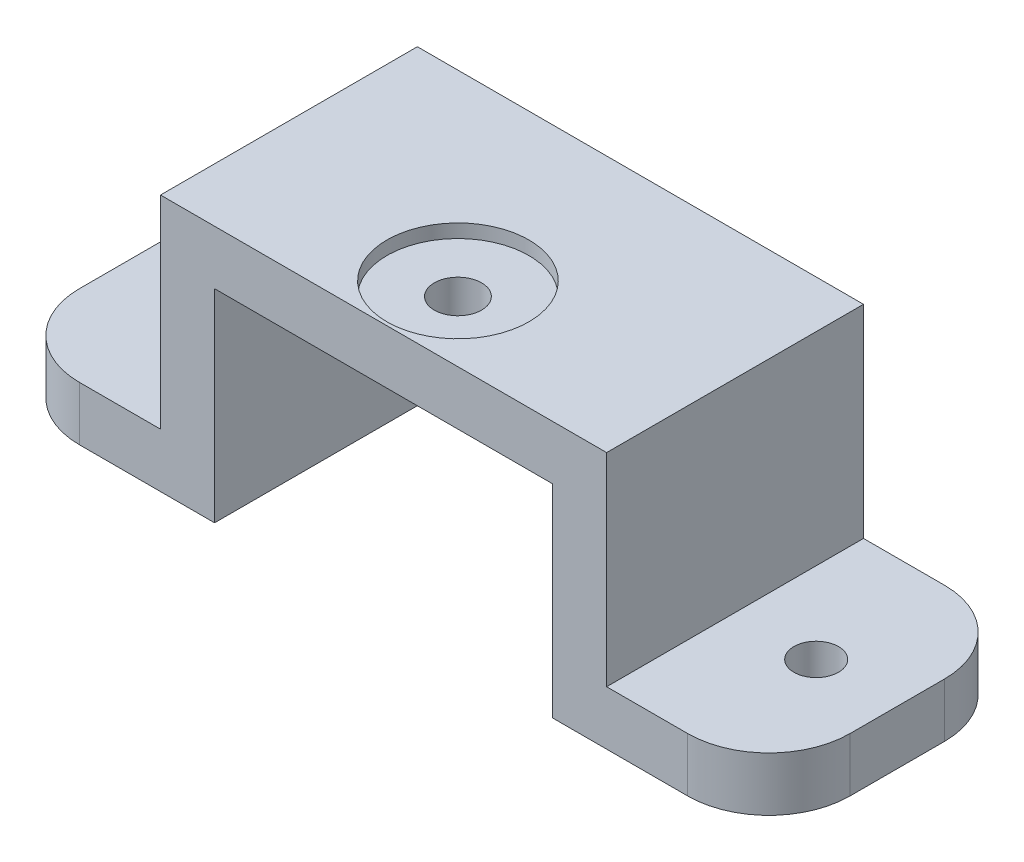
ISO-10303-21;
HEADER;
FILE_DESCRIPTION(('STEP AP214'),'2;1');
FILE_NAME('part.step','',(''),(''),'','','');
FILE_SCHEMA(('AUTOMOTIVE_DESIGN { 1 0 10303 214 1 1 1 1 }'));
ENDSEC;
DATA;
#1=APPLICATION_CONTEXT('core data for automotive mechanical design processes');
#2=APPLICATION_PROTOCOL_DEFINITION('international standard','automotive_design',2000,#1);
#3=PRODUCT_CONTEXT('',#1,'mechanical');
#4=PRODUCT('Part','Part','',(#3));
#5=PRODUCT_RELATED_PRODUCT_CATEGORY('part','',(#4));
#6=PRODUCT_DEFINITION_FORMATION('','',#4);
#7=PRODUCT_DEFINITION_CONTEXT('part definition',#1,'design');
#8=PRODUCT_DEFINITION('design','',#6,#7);
#9=PRODUCT_DEFINITION_SHAPE('','',#8);
#10=(LENGTH_UNIT() NAMED_UNIT(*) SI_UNIT(.MILLI.,.METRE.));
#11=(NAMED_UNIT(*) PLANE_ANGLE_UNIT() SI_UNIT($,.RADIAN.));
#12=(NAMED_UNIT(*) SI_UNIT($,.STERADIAN.) SOLID_ANGLE_UNIT());
#13=UNCERTAINTY_MEASURE_WITH_UNIT(LENGTH_MEASURE(1.E-05),#10,'distance_accuracy_value','');
#14=(GEOMETRIC_REPRESENTATION_CONTEXT(3) GLOBAL_UNCERTAINTY_ASSIGNED_CONTEXT((#13)) GLOBAL_UNIT_ASSIGNED_CONTEXT((#10,
#11,#12)) REPRESENTATION_CONTEXT('',''));
#15=CARTESIAN_POINT('',(0.,0.,0.));
#16=DIRECTION('',(0.,0.,1.));
#17=DIRECTION('',(1.,0.,0.));
#18=AXIS2_PLACEMENT_3D('',#15,#16,#17);
#19=CARTESIAN_POINT('',(0.,0.,13.5));
#20=DIRECTION('',(0.,1.,0.));
#21=DIRECTION('',(0.,0.,1.));
#22=AXIS2_PLACEMENT_3D('',#19,#20,#21);
#23=CYLINDRICAL_SURFACE('',#22,1.75);
#24=CARTESIAN_POINT('',(0.,15.,13.5));
#25=DIRECTION('',(0.,1.,0.));
#26=DIRECTION('',(0.,0.,1.));
#27=AXIS2_PLACEMENT_3D('',#24,#25,#26);
#28=CIRCLE('',#27,1.75);
#29=CARTESIAN_POINT('',(0.,15.,15.25));
#30=VERTEX_POINT('',#29);
#31=EDGE_CURVE('E182',#30,#30,#28,.T.);
#32=ORIENTED_EDGE('',*,*,#31,.F.);
#33=EDGE_LOOP('',(#32));
#34=FACE_BOUND('',#33,.T.);
#35=CARTESIAN_POINT('',(0.,18.,13.5));
#36=DIRECTION('',(0.,1.,0.));
#37=DIRECTION('',(0.,0.,1.));
#38=AXIS2_PLACEMENT_3D('',#35,#36,#37);
#39=CIRCLE('',#38,1.75);
#40=CARTESIAN_POINT('',(0.,18.,15.25));
#41=VERTEX_POINT('',#40);
#42=EDGE_CURVE('E36',#41,#41,#39,.F.);
#43=ORIENTED_EDGE('',*,*,#42,.F.);
#44=EDGE_LOOP('',(#43));
#45=FACE_BOUND('',#44,.T.);
#46=ADVANCED_FACE('F32',(#34,#45),#23,.F.);
#47=CARTESIAN_POINT('',(22.5,0.,9.49999999999999));
#48=DIRECTION('',(0.,1.,0.));
#49=DIRECTION('',(0.,0.,1.));
#50=AXIS2_PLACEMENT_3D('',#47,#48,#49);
#51=CYLINDRICAL_SURFACE('',#50,1.65);
#52=CARTESIAN_POINT('',(22.5,4.,9.49999999999999));
#53=DIRECTION('',(0.,-1.,0.));
#54=DIRECTION('',(1.,0.,0.));
#55=AXIS2_PLACEMENT_3D('',#52,#53,#54);
#56=CIRCLE('',#55,1.65);
#57=CARTESIAN_POINT('',(24.15,4.00000000000001,9.49999999999999));
#58=VERTEX_POINT('',#57);
#59=EDGE_CURVE('E186',#58,#58,#56,.T.);
#60=ORIENTED_EDGE('',*,*,#59,.F.);
#61=EDGE_LOOP('',(#60));
#62=FACE_BOUND('',#61,.T.);
#63=CARTESIAN_POINT('',(22.5,0.999999999999995,9.49999999999999));
#64=DIRECTION('',(0.,-1.,0.));
#65=DIRECTION('',(1.,0.,0.));
#66=AXIS2_PLACEMENT_3D('',#63,#64,#65);
#67=CIRCLE('',#66,1.65);
#68=CARTESIAN_POINT('',(24.15,0.999999999999995,9.49999999999999));
#69=VERTEX_POINT('',#68);
#70=EDGE_CURVE('E220',#69,#69,#67,.F.);
#71=ORIENTED_EDGE('',*,*,#70,.F.);
#72=EDGE_LOOP('',(#71));
#73=FACE_BOUND('',#72,.T.);
#74=ADVANCED_FACE('F337',(#62,#73),#51,.F.);
#75=CARTESIAN_POINT('',(-22.5,0.,9.5));
#76=DIRECTION('',(0.,1.,0.));
#77=DIRECTION('',(0.,0.,1.));
#78=AXIS2_PLACEMENT_3D('',#75,#76,#77);
#79=CYLINDRICAL_SURFACE('',#78,1.65);
#80=CARTESIAN_POINT('',(-22.5,4.,9.5));
#81=DIRECTION('',(0.,-1.,0.));
#82=DIRECTION('',(1.,0.,0.));
#83=AXIS2_PLACEMENT_3D('',#80,#81,#82);
#84=CIRCLE('',#83,1.65);
#85=CARTESIAN_POINT('',(-20.85,4.,9.5));
#86=VERTEX_POINT('',#85);
#87=EDGE_CURVE('E185',#86,#86,#84,.T.);
#88=ORIENTED_EDGE('',*,*,#87,.F.);
#89=EDGE_LOOP('',(#88));
#90=FACE_BOUND('',#89,.T.);
#91=CARTESIAN_POINT('',(-22.5,1.,9.5));
#92=DIRECTION('',(0.,-1.,0.));
#93=DIRECTION('',(1.,0.,0.));
#94=AXIS2_PLACEMENT_3D('',#91,#92,#93);
#95=CIRCLE('',#94,1.65);
#96=CARTESIAN_POINT('',(-20.85,1.,9.5));
#97=VERTEX_POINT('',#96);
#98=EDGE_CURVE('E188',#97,#97,#95,.F.);
#99=ORIENTED_EDGE('',*,*,#98,.F.);
#100=EDGE_LOOP('',(#99));
#101=FACE_BOUND('',#100,.T.);
#102=ADVANCED_FACE('F343',(#90,#101),#79,.F.);
#103=CARTESIAN_POINT('',(16.5,19.,19.));
#104=DIRECTION('',(-1.,0.,0.));
#105=DIRECTION('',(0.,0.,1.));
#106=AXIS2_PLACEMENT_3D('',#103,#104,#105);
#107=PLANE('',#106);
#108=DIRECTION('',(0.,1.,0.));
#109=VECTOR('',#108,1.);
#110=CARTESIAN_POINT('',(16.5,19.,0.));
#111=LINE('',#110,#109);
#112=CARTESIAN_POINT('',(16.5,4.,0.));
#113=VERTEX_POINT('',#112);
#114=CARTESIAN_POINT('',(16.5,19.,0.));
#115=VERTEX_POINT('',#114);
#116=EDGE_CURVE('E173',#113,#115,#111,.T.);
#117=ORIENTED_EDGE('',*,*,#116,.T.);
#118=DIRECTION('',(0.,0.,-1.));
#119=VECTOR('',#118,1.);
#120=CARTESIAN_POINT('',(16.5,19.,19.));
#121=LINE('',#120,#119);
#122=CARTESIAN_POINT('',(16.5,19.,19.));
#123=VERTEX_POINT('',#122);
#124=EDGE_CURVE('E151',#123,#115,#121,.T.);
#125=ORIENTED_EDGE('',*,*,#124,.F.);
#126=DIRECTION('',(0.,1.,0.));
#127=VECTOR('',#126,1.);
#128=CARTESIAN_POINT('',(16.5,19.,19.));
#129=LINE('',#128,#127);
#130=CARTESIAN_POINT('',(16.5,4.,19.));
#131=VERTEX_POINT('',#130);
#132=EDGE_CURVE('E158',#131,#123,#129,.T.);
#133=ORIENTED_EDGE('',*,*,#132,.F.);
#134=DIRECTION('',(0.,0.,-1.));
#135=VECTOR('',#134,1.);
#136=CARTESIAN_POINT('',(16.5,4.,19.));
#137=LINE('',#136,#135);
#138=EDGE_CURVE('E258',#131,#113,#137,.T.);
#139=ORIENTED_EDGE('',*,*,#138,.T.);
#140=EDGE_LOOP('',(#117,#125,#133,#139));
#141=FACE_BOUND('',#140,.T.);
#142=ADVANCED_FACE('F171',(#141),#107,.F.);
#143=CARTESIAN_POINT('',(16.5,19.,19.));
#144=DIRECTION('',(0.,-1.,0.));
#145=DIRECTION('',(0.,0.,-1.));
#146=AXIS2_PLACEMENT_3D('',#143,#144,#145);
#147=PLANE('',#146);
#148=CARTESIAN_POINT('',(0.,19.,13.5));
#149=DIRECTION('',(0.,1.,0.));
#150=DIRECTION('',(0.,0.,1.));
#151=AXIS2_PLACEMENT_3D('',#148,#149,#150);
#152=CIRCLE('',#151,5.25);
#153=CARTESIAN_POINT('',(0.,19.,18.75));
#154=VERTEX_POINT('',#153);
#155=EDGE_CURVE('E236',#154,#154,#152,.T.);
#156=ORIENTED_EDGE('',*,*,#155,.F.);
#157=EDGE_LOOP('',(#156));
#158=FACE_BOUND('',#157,.T.);
#159=DIRECTION('',(-1.,0.,0.));
#160=VECTOR('',#159,1.);
#161=CARTESIAN_POINT('',(16.5,19.,0.));
#162=LINE('',#161,#160);
#163=CARTESIAN_POINT('',(-16.5,19.,0.));
#164=VERTEX_POINT('',#163);
#165=EDGE_CURVE('E260',#115,#164,#162,.T.);
#166=ORIENTED_EDGE('',*,*,#165,.T.);
#167=DIRECTION('',(0.,0.,-1.));
#168=VECTOR('',#167,1.);
#169=CARTESIAN_POINT('',(-16.5,19.,19.));
#170=LINE('',#169,#168);
#171=CARTESIAN_POINT('',(-16.5,19.,19.));
#172=VERTEX_POINT('',#171);
#173=EDGE_CURVE('E154',#172,#164,#170,.T.);
#174=ORIENTED_EDGE('',*,*,#173,.F.);
#175=DIRECTION('',(-1.,0.,0.));
#176=VECTOR('',#175,1.);
#177=CARTESIAN_POINT('',(16.5,19.,19.));
#178=LINE('',#177,#176);
#179=EDGE_CURVE('E147',#123,#172,#178,.T.);
#180=ORIENTED_EDGE('',*,*,#179,.F.);
#181=ORIENTED_EDGE('',*,*,#124,.T.);
#182=EDGE_LOOP('',(#166,#174,#180,#181));
#183=FACE_BOUND('',#182,.T.);
#184=ADVANCED_FACE('F149',(#158,#183),#147,.F.);
#185=CARTESIAN_POINT('',(-16.5,19.,19.));
#186=DIRECTION('',(1.,0.,0.));
#187=DIRECTION('',(0.,0.,-1.));
#188=AXIS2_PLACEMENT_3D('',#185,#186,#187);
#189=PLANE('',#188);
#190=DIRECTION('',(0.,-1.,0.));
#191=VECTOR('',#190,1.);
#192=CARTESIAN_POINT('',(-16.5,19.,0.));
#193=LINE('',#192,#191);
#194=CARTESIAN_POINT('',(-16.5,4.,0.));
#195=VERTEX_POINT('',#194);
#196=EDGE_CURVE('E262',#164,#195,#193,.T.);
#197=ORIENTED_EDGE('',*,*,#196,.T.);
#198=DIRECTION('',(0.,0.,-1.));
#199=VECTOR('',#198,1.);
#200=CARTESIAN_POINT('',(-16.5,4.,19.));
#201=LINE('',#200,#199);
#202=CARTESIAN_POINT('',(-16.5,4.,19.));
#203=VERTEX_POINT('',#202);
#204=EDGE_CURVE('E178',#203,#195,#201,.T.);
#205=ORIENTED_EDGE('',*,*,#204,.F.);
#206=DIRECTION('',(0.,-1.,0.));
#207=VECTOR('',#206,1.);
#208=CARTESIAN_POINT('',(-16.5,19.,19.));
#209=LINE('',#208,#207);
#210=EDGE_CURVE('E157',#172,#203,#209,.T.);
#211=ORIENTED_EDGE('',*,*,#210,.F.);
#212=ORIENTED_EDGE('',*,*,#173,.T.);
#213=EDGE_LOOP('',(#197,#205,#211,#212));
#214=FACE_BOUND('',#213,.T.);
#215=ADVANCED_FACE('F325',(#214),#189,.F.);
#216=CARTESIAN_POINT('',(-16.5,4.,19.));
#217=DIRECTION('',(0.,-1.,0.));
#218=DIRECTION('',(1.,0.,0.));
#219=AXIS2_PLACEMENT_3D('',#216,#217,#218);
#220=PLANE('',#219);
#221=ORIENTED_EDGE('',*,*,#87,.T.);
#222=EDGE_LOOP('',(#221));
#223=FACE_BOUND('',#222,.T.);
#224=DIRECTION('',(-1.,0.,0.));
#225=VECTOR('',#224,1.);
#226=CARTESIAN_POINT('',(-16.5,4.,0.));
#227=LINE('',#226,#225);
#228=CARTESIAN_POINT('',(-22.5,4.,0.));
#229=VERTEX_POINT('',#228);
#230=EDGE_CURVE('E264',#195,#229,#227,.T.);
#231=ORIENTED_EDGE('',*,*,#230,.T.);
#232=CARTESIAN_POINT('',(-22.5,4.,6.));
#233=DIRECTION('',(0.,-1.,0.));
#234=DIRECTION('',(1.,0.,0.));
#235=AXIS2_PLACEMENT_3D('',#232,#233,#234);
#236=CIRCLE('',#235,6.);
#237=CARTESIAN_POINT('',(-28.5,4.,6.));
#238=VERTEX_POINT('',#237);
#239=EDGE_CURVE('E11',#229,#238,#236,.F.);
#240=ORIENTED_EDGE('',*,*,#239,.T.);
#241=DIRECTION('',(0.,0.,-1.));
#242=VECTOR('',#241,1.);
#243=CARTESIAN_POINT('',(-28.5,4.,19.));
#244=LINE('',#243,#242);
#245=CARTESIAN_POINT('',(-28.5,4.,13.));
#246=VERTEX_POINT('',#245);
#247=EDGE_CURVE('E300',#246,#238,#244,.T.);
#248=ORIENTED_EDGE('',*,*,#247,.F.);
#249=CARTESIAN_POINT('',(-22.5,4.,13.));
#250=DIRECTION('',(0.,-1.,0.));
#251=DIRECTION('',(1.,0.,0.));
#252=AXIS2_PLACEMENT_3D('',#249,#250,#251);
#253=CIRCLE('',#252,6.);
#254=CARTESIAN_POINT('',(-22.5,4.,19.));
#255=VERTEX_POINT('',#254);
#256=EDGE_CURVE('E41',#246,#255,#253,.F.);
#257=ORIENTED_EDGE('',*,*,#256,.T.);
#258=DIRECTION('',(-1.,0.,0.));
#259=VECTOR('',#258,1.);
#260=CARTESIAN_POINT('',(-16.5,4.,19.));
#261=LINE('',#260,#259);
#262=EDGE_CURVE('E244',#203,#255,#261,.T.);
#263=ORIENTED_EDGE('',*,*,#262,.F.);
#264=ORIENTED_EDGE('',*,*,#204,.T.);
#265=EDGE_LOOP('',(#231,#240,#248,#257,#263,#264));
#266=FACE_BOUND('',#265,.T.);
#267=ADVANCED_FACE('F305',(#223,#266),#220,.F.);
#268=CARTESIAN_POINT('',(-28.5,0.,19.));
#269=DIRECTION('',(1.,0.,0.));
#270=DIRECTION('',(0.,0.,-1.));
#271=AXIS2_PLACEMENT_3D('',#268,#269,#270);
#272=PLANE('',#271);
#273=ORIENTED_EDGE('',*,*,#247,.T.);
#274=DIRECTION('',(0.,-1.,0.));
#275=VECTOR('',#274,1.);
#276=CARTESIAN_POINT('',(-28.5,0.,6.));
#277=LINE('',#276,#275);
#278=CARTESIAN_POINT('',(-28.5,0.,6.));
#279=VERTEX_POINT('',#278);
#280=EDGE_CURVE('E210',#238,#279,#277,.T.);
#281=ORIENTED_EDGE('',*,*,#280,.T.);
#282=DIRECTION('',(0.,0.,-1.));
#283=VECTOR('',#282,1.);
#284=CARTESIAN_POINT('',(-28.5,0.,19.));
#285=LINE('',#284,#283);
#286=CARTESIAN_POINT('',(-28.5,0.,13.));
#287=VERTEX_POINT('',#286);
#288=EDGE_CURVE('E297',#287,#279,#285,.T.);
#289=ORIENTED_EDGE('',*,*,#288,.F.);
#290=DIRECTION('',(0.,-1.,0.));
#291=VECTOR('',#290,1.);
#292=CARTESIAN_POINT('',(-28.5,4.,13.));
#293=LINE('',#292,#291);
#294=EDGE_CURVE('E54',#287,#246,#293,.F.);
#295=ORIENTED_EDGE('',*,*,#294,.T.);
#296=EDGE_LOOP('',(#273,#281,#289,#295));
#297=FACE_BOUND('',#296,.T.);
#298=ADVANCED_FACE('F317',(#297),#272,.F.);
#299=CARTESIAN_POINT('',(-12.5,0.,19.));
#300=DIRECTION('',(0.,1.,0.));
#301=DIRECTION('',(-1.,0.,0.));
#302=AXIS2_PLACEMENT_3D('',#299,#300,#301);
#303=PLANE('',#302);
#304=CARTESIAN_POINT('',(-22.5,0.,9.5));
#305=DIRECTION('',(0.,-1.,0.));
#306=DIRECTION('',(1.,0.,0.));
#307=AXIS2_PLACEMENT_3D('',#304,#305,#306);
#308=CIRCLE('',#307,5.);
#309=CARTESIAN_POINT('',(-17.5,0.,9.5));
#310=VERTEX_POINT('',#309);
#311=EDGE_CURVE('E222',#310,#310,#308,.T.);
#312=ORIENTED_EDGE('',*,*,#311,.F.);
#313=EDGE_LOOP('',(#312));
#314=FACE_BOUND('',#313,.T.);
#315=ORIENTED_EDGE('',*,*,#288,.T.);
#316=CARTESIAN_POINT('',(-22.5,0.,6.));
#317=DIRECTION('',(0.,1.,0.));
#318=DIRECTION('',(-1.,0.,0.));
#319=AXIS2_PLACEMENT_3D('',#316,#317,#318);
#320=CIRCLE('',#319,6.);
#321=CARTESIAN_POINT('',(-22.5,0.,0.));
#322=VERTEX_POINT('',#321);
#323=EDGE_CURVE('E215',#279,#322,#320,.F.);
#324=ORIENTED_EDGE('',*,*,#323,.T.);
#325=DIRECTION('',(1.,0.,0.));
#326=VECTOR('',#325,1.);
#327=CARTESIAN_POINT('',(-12.5,0.,0.));
#328=LINE('',#327,#326);
#329=CARTESIAN_POINT('',(-12.5,0.,0.));
#330=VERTEX_POINT('',#329);
#331=EDGE_CURVE('E266',#322,#330,#328,.T.);
#332=ORIENTED_EDGE('',*,*,#331,.T.);
#333=DIRECTION('',(0.,0.,-1.));
#334=VECTOR('',#333,1.);
#335=CARTESIAN_POINT('',(-12.5,0.,19.));
#336=LINE('',#335,#334);
#337=CARTESIAN_POINT('',(-12.5,0.,19.));
#338=VERTEX_POINT('',#337);
#339=EDGE_CURVE('E294',#338,#330,#336,.T.);
#340=ORIENTED_EDGE('',*,*,#339,.F.);
#341=DIRECTION('',(1.,0.,0.));
#342=VECTOR('',#341,1.);
#343=CARTESIAN_POINT('',(-12.5,0.,19.));
#344=LINE('',#343,#342);
#345=CARTESIAN_POINT('',(-22.5,0.,19.));
#346=VERTEX_POINT('',#345);
#347=EDGE_CURVE('E247',#346,#338,#344,.T.);
#348=ORIENTED_EDGE('',*,*,#347,.F.);
#349=CARTESIAN_POINT('',(-22.5,0.,13.));
#350=DIRECTION('',(0.,1.,0.));
#351=DIRECTION('',(-1.,0.,0.));
#352=AXIS2_PLACEMENT_3D('',#349,#350,#351);
#353=CIRCLE('',#352,6.);
#354=EDGE_CURVE('E213',#346,#287,#353,.F.);
#355=ORIENTED_EDGE('',*,*,#354,.T.);
#356=EDGE_LOOP('',(#315,#324,#332,#340,#348,#355));
#357=FACE_BOUND('',#356,.T.);
#358=ADVANCED_FACE('F319',(#314,#357),#303,.F.);
#359=CARTESIAN_POINT('',(-12.5,15.,19.));
#360=DIRECTION('',(-1.,0.,0.));
#361=DIRECTION('',(0.,0.,1.));
#362=AXIS2_PLACEMENT_3D('',#359,#360,#361);
#363=PLANE('',#362);
#364=DIRECTION('',(0.,1.,0.));
#365=VECTOR('',#364,1.);
#366=CARTESIAN_POINT('',(-12.5,15.,0.));
#367=LINE('',#366,#365);
#368=CARTESIAN_POINT('',(-12.5,15.,0.));
#369=VERTEX_POINT('',#368);
#370=EDGE_CURVE('E268',#330,#369,#367,.T.);
#371=ORIENTED_EDGE('',*,*,#370,.T.);
#372=DIRECTION('',(0.,0.,-1.));
#373=VECTOR('',#372,1.);
#374=CARTESIAN_POINT('',(-12.5,15.,19.));
#375=LINE('',#374,#373);
#376=CARTESIAN_POINT('',(-12.5,15.,19.));
#377=VERTEX_POINT('',#376);
#378=EDGE_CURVE('E291',#377,#369,#375,.T.);
#379=ORIENTED_EDGE('',*,*,#378,.F.);
#380=DIRECTION('',(0.,1.,0.));
#381=VECTOR('',#380,1.);
#382=CARTESIAN_POINT('',(-12.5,15.,19.));
#383=LINE('',#382,#381);
#384=EDGE_CURVE('E249',#338,#377,#383,.T.);
#385=ORIENTED_EDGE('',*,*,#384,.F.);
#386=ORIENTED_EDGE('',*,*,#339,.T.);
#387=EDGE_LOOP('',(#371,#379,#385,#386));
#388=FACE_BOUND('',#387,.T.);
#389=ADVANCED_FACE('F374',(#388),#363,.F.);
#390=CARTESIAN_POINT('',(12.5,15.,19.));
#391=DIRECTION('',(0.,1.,0.));
#392=DIRECTION('',(0.,0.,1.));
#393=AXIS2_PLACEMENT_3D('',#390,#391,#392);
#394=PLANE('',#393);
#395=ORIENTED_EDGE('',*,*,#31,.T.);
#396=EDGE_LOOP('',(#395));
#397=FACE_BOUND('',#396,.T.);
#398=DIRECTION('',(1.,0.,0.));
#399=VECTOR('',#398,1.);
#400=CARTESIAN_POINT('',(12.5,15.,0.));
#401=LINE('',#400,#399);
#402=CARTESIAN_POINT('',(12.5,15.,0.));
#403=VERTEX_POINT('',#402);
#404=EDGE_CURVE('E270',#369,#403,#401,.T.);
#405=ORIENTED_EDGE('',*,*,#404,.T.);
#406=DIRECTION('',(0.,0.,-1.));
#407=VECTOR('',#406,1.);
#408=CARTESIAN_POINT('',(12.5,15.,19.));
#409=LINE('',#408,#407);
#410=CARTESIAN_POINT('',(12.5,15.,19.));
#411=VERTEX_POINT('',#410);
#412=EDGE_CURVE('E288',#411,#403,#409,.T.);
#413=ORIENTED_EDGE('',*,*,#412,.F.);
#414=DIRECTION('',(1.,0.,0.));
#415=VECTOR('',#414,1.);
#416=CARTESIAN_POINT('',(12.5,15.,19.));
#417=LINE('',#416,#415);
#418=EDGE_CURVE('E251',#377,#411,#417,.T.);
#419=ORIENTED_EDGE('',*,*,#418,.F.);
#420=ORIENTED_EDGE('',*,*,#378,.T.);
#421=EDGE_LOOP('',(#405,#413,#419,#420));
#422=FACE_BOUND('',#421,.T.);
#423=ADVANCED_FACE('F370',(#397,#422),#394,.F.);
#424=CARTESIAN_POINT('',(12.5,15.,19.));
#425=DIRECTION('',(1.,0.,0.));
#426=DIRECTION('',(0.,0.,-1.));
#427=AXIS2_PLACEMENT_3D('',#424,#425,#426);
#428=PLANE('',#427);
#429=DIRECTION('',(0.,-1.,0.));
#430=VECTOR('',#429,1.);
#431=CARTESIAN_POINT('',(12.5,15.,0.));
#432=LINE('',#431,#430);
#433=CARTESIAN_POINT('',(12.5,0.,0.));
#434=VERTEX_POINT('',#433);
#435=EDGE_CURVE('E272',#403,#434,#432,.T.);
#436=ORIENTED_EDGE('',*,*,#435,.T.);
#437=DIRECTION('',(0.,0.,-1.));
#438=VECTOR('',#437,1.);
#439=CARTESIAN_POINT('',(12.5,0.,19.));
#440=LINE('',#439,#438);
#441=CARTESIAN_POINT('',(12.5,0.,19.));
#442=VERTEX_POINT('',#441);
#443=EDGE_CURVE('E285',#442,#434,#440,.T.);
#444=ORIENTED_EDGE('',*,*,#443,.F.);
#445=DIRECTION('',(0.,-1.,0.));
#446=VECTOR('',#445,1.);
#447=CARTESIAN_POINT('',(12.5,15.,19.));
#448=LINE('',#447,#446);
#449=EDGE_CURVE('E253',#411,#442,#448,.T.);
#450=ORIENTED_EDGE('',*,*,#449,.F.);
#451=ORIENTED_EDGE('',*,*,#412,.T.);
#452=EDGE_LOOP('',(#436,#444,#450,#451));
#453=FACE_BOUND('',#452,.T.);
#454=ADVANCED_FACE('F366',(#453),#428,.F.);
#455=CARTESIAN_POINT('',(12.5,0.,19.));
#456=DIRECTION('',(0.,1.,0.));
#457=DIRECTION('',(-1.,0.,0.));
#458=AXIS2_PLACEMENT_3D('',#455,#456,#457);
#459=PLANE('',#458);
#460=CARTESIAN_POINT('',(22.5,0.,9.49999999999999));
#461=DIRECTION('',(0.,-1.,0.));
#462=DIRECTION('',(1.,0.,0.));
#463=AXIS2_PLACEMENT_3D('',#460,#461,#462);
#464=CIRCLE('',#463,5.);
#465=CARTESIAN_POINT('',(27.5,0.,9.49999999999999));
#466=VERTEX_POINT('',#465);
#467=EDGE_CURVE('E229',#466,#466,#464,.T.);
#468=ORIENTED_EDGE('',*,*,#467,.F.);
#469=EDGE_LOOP('',(#468));
#470=FACE_BOUND('',#469,.T.);
#471=DIRECTION('',(1.,0.,0.));
#472=VECTOR('',#471,1.);
#473=CARTESIAN_POINT('',(12.5,0.,0.));
#474=LINE('',#473,#472);
#475=CARTESIAN_POINT('',(22.5,0.,0.));
#476=VERTEX_POINT('',#475);
#477=EDGE_CURVE('E274',#434,#476,#474,.T.);
#478=ORIENTED_EDGE('',*,*,#477,.T.);
#479=CARTESIAN_POINT('',(22.5,0.,6.));
#480=DIRECTION('',(0.,1.,0.));
#481=DIRECTION('',(-1.,0.,0.));
#482=AXIS2_PLACEMENT_3D('',#479,#480,#481);
#483=CIRCLE('',#482,6.);
#484=CARTESIAN_POINT('',(28.5,0.,6.));
#485=VERTEX_POINT('',#484);
#486=EDGE_CURVE('E202',#476,#485,#483,.F.);
#487=ORIENTED_EDGE('',*,*,#486,.T.);
#488=DIRECTION('',(0.,0.,-1.));
#489=VECTOR('',#488,1.);
#490=CARTESIAN_POINT('',(28.5,0.,19.));
#491=LINE('',#490,#489);
#492=CARTESIAN_POINT('',(28.5,0.,13.));
#493=VERTEX_POINT('',#492);
#494=EDGE_CURVE('E282',#493,#485,#491,.T.);
#495=ORIENTED_EDGE('',*,*,#494,.F.);
#496=CARTESIAN_POINT('',(22.5,0.,13.));
#497=DIRECTION('',(0.,1.,0.));
#498=DIRECTION('',(-1.,0.,0.));
#499=AXIS2_PLACEMENT_3D('',#496,#497,#498);
#500=CIRCLE('',#499,6.);
#501=CARTESIAN_POINT('',(22.5,0.,19.));
#502=VERTEX_POINT('',#501);
#503=EDGE_CURVE('E200',#493,#502,#500,.F.);
#504=ORIENTED_EDGE('',*,*,#503,.T.);
#505=DIRECTION('',(1.,0.,0.));
#506=VECTOR('',#505,1.);
#507=CARTESIAN_POINT('',(12.5,0.,19.));
#508=LINE('',#507,#506);
#509=EDGE_CURVE('E255',#442,#502,#508,.T.);
#510=ORIENTED_EDGE('',*,*,#509,.F.);
#511=ORIENTED_EDGE('',*,*,#443,.T.);
#512=EDGE_LOOP('',(#478,#487,#495,#504,#510,#511));
#513=FACE_BOUND('',#512,.T.);
#514=ADVANCED_FACE('F362',(#470,#513),#459,.F.);
#515=CARTESIAN_POINT('',(28.5,0.,19.));
#516=DIRECTION('',(-1.,0.,0.));
#517=DIRECTION('',(0.,0.,1.));
#518=AXIS2_PLACEMENT_3D('',#515,#516,#517);
#519=PLANE('',#518);
#520=ORIENTED_EDGE('',*,*,#494,.T.);
#521=DIRECTION('',(0.,1.,0.));
#522=VECTOR('',#521,1.);
#523=CARTESIAN_POINT('',(28.5,0.,6.));
#524=LINE('',#523,#522);
#525=CARTESIAN_POINT('',(28.5,4.00000000000001,6.));
#526=VERTEX_POINT('',#525);
#527=EDGE_CURVE('E176',#485,#526,#524,.T.);
#528=ORIENTED_EDGE('',*,*,#527,.T.);
#529=DIRECTION('',(0.,0.,-1.));
#530=VECTOR('',#529,1.);
#531=CARTESIAN_POINT('',(28.5,4.00000000000001,19.));
#532=LINE('',#531,#530);
#533=CARTESIAN_POINT('',(28.5,4.00000000000001,13.));
#534=VERTEX_POINT('',#533);
#535=EDGE_CURVE('E279',#534,#526,#532,.T.);
#536=ORIENTED_EDGE('',*,*,#535,.F.);
#537=DIRECTION('',(0.,1.,0.));
#538=VECTOR('',#537,1.);
#539=CARTESIAN_POINT('',(28.5,0.,13.));
#540=LINE('',#539,#538);
#541=EDGE_CURVE('E174',#534,#493,#540,.F.);
#542=ORIENTED_EDGE('',*,*,#541,.T.);
#543=EDGE_LOOP('',(#520,#528,#536,#542));
#544=FACE_BOUND('',#543,.T.);
#545=ADVANCED_FACE('F358',(#544),#519,.F.);
#546=CARTESIAN_POINT('',(16.5,4.,19.));
#547=DIRECTION('',(0.,-1.,0.));
#548=DIRECTION('',(1.,0.,0.));
#549=AXIS2_PLACEMENT_3D('',#546,#547,#548);
#550=PLANE('',#549);
#551=ORIENTED_EDGE('',*,*,#59,.T.);
#552=EDGE_LOOP('',(#551));
#553=FACE_BOUND('',#552,.T.);
#554=ORIENTED_EDGE('',*,*,#535,.T.);
#555=CARTESIAN_POINT('',(22.5,4.,6.));
#556=DIRECTION('',(0.,-1.,0.));
#557=DIRECTION('',(1.,0.,0.));
#558=AXIS2_PLACEMENT_3D('',#555,#556,#557);
#559=CIRCLE('',#558,6.);
#560=CARTESIAN_POINT('',(22.5,4.,0.));
#561=VERTEX_POINT('',#560);
#562=EDGE_CURVE('E194',#526,#561,#559,.F.);
#563=ORIENTED_EDGE('',*,*,#562,.T.);
#564=DIRECTION('',(-1.,0.,0.));
#565=VECTOR('',#564,1.);
#566=CARTESIAN_POINT('',(16.5,4.,0.));
#567=LINE('',#566,#565);
#568=EDGE_CURVE('E169',#561,#113,#567,.T.);
#569=ORIENTED_EDGE('',*,*,#568,.T.);
#570=ORIENTED_EDGE('',*,*,#138,.F.);
#571=DIRECTION('',(-1.,0.,0.));
#572=VECTOR('',#571,1.);
#573=CARTESIAN_POINT('',(16.5,4.,19.));
#574=LINE('',#573,#572);
#575=CARTESIAN_POINT('',(22.5,4.,19.));
#576=VERTEX_POINT('',#575);
#577=EDGE_CURVE('E165',#576,#131,#574,.T.);
#578=ORIENTED_EDGE('',*,*,#577,.F.);
#579=CARTESIAN_POINT('',(22.5,4.,13.));
#580=DIRECTION('',(0.,-1.,0.));
#581=DIRECTION('',(1.,0.,0.));
#582=AXIS2_PLACEMENT_3D('',#579,#580,#581);
#583=CIRCLE('',#582,6.);
#584=EDGE_CURVE('E192',#576,#534,#583,.F.);
#585=ORIENTED_EDGE('',*,*,#584,.T.);
#586=EDGE_LOOP('',(#554,#563,#569,#570,#578,#585));
#587=FACE_BOUND('',#586,.T.);
#588=ADVANCED_FACE('F352',(#553,#587),#550,.F.);
#589=CARTESIAN_POINT('',(0.,0.,19.));
#590=DIRECTION('',(0.,0.,1.));
#591=DIRECTION('',(1.,0.,0.));
#592=AXIS2_PLACEMENT_3D('',#589,#590,#591);
#593=PLANE('',#592);
#594=ORIENTED_EDGE('',*,*,#509,.T.);
#595=DIRECTION('',(0.,1.,0.));
#596=VECTOR('',#595,1.);
#597=CARTESIAN_POINT('',(22.5,4.00000000000001,19.));
#598=LINE('',#597,#596);
#599=EDGE_CURVE('E207',#502,#576,#598,.T.);
#600=ORIENTED_EDGE('',*,*,#599,.T.);
#601=ORIENTED_EDGE('',*,*,#577,.T.);
#602=ORIENTED_EDGE('',*,*,#132,.T.);
#603=ORIENTED_EDGE('',*,*,#179,.T.);
#604=ORIENTED_EDGE('',*,*,#210,.T.);
#605=ORIENTED_EDGE('',*,*,#262,.T.);
#606=DIRECTION('',(0.,-1.,0.));
#607=VECTOR('',#606,1.);
#608=CARTESIAN_POINT('',(-22.5,0.,19.));
#609=LINE('',#608,#607);
#610=EDGE_CURVE('E204',#255,#346,#609,.T.);
#611=ORIENTED_EDGE('',*,*,#610,.T.);
#612=ORIENTED_EDGE('',*,*,#347,.T.);
#613=ORIENTED_EDGE('',*,*,#384,.T.);
#614=ORIENTED_EDGE('',*,*,#418,.T.);
#615=ORIENTED_EDGE('',*,*,#449,.T.);
#616=EDGE_LOOP('',(#594,#600,#601,#602,#603,#604,#605,#611,#612,#613,#614,#615));
#617=FACE_BOUND('',#616,.T.);
#618=ADVANCED_FACE('F162',(#617),#593,.T.);
#619=CARTESIAN_POINT('',(0.,0.,0.));
#620=DIRECTION('',(0.,0.,1.));
#621=DIRECTION('',(1.,0.,0.));
#622=AXIS2_PLACEMENT_3D('',#619,#620,#621);
#623=PLANE('',#622);
#624=ORIENTED_EDGE('',*,*,#568,.F.);
#625=DIRECTION('',(0.,1.,0.));
#626=VECTOR('',#625,1.);
#627=CARTESIAN_POINT('',(22.5,0.,0.));
#628=LINE('',#627,#626);
#629=EDGE_CURVE('E198',#561,#476,#628,.F.);
#630=ORIENTED_EDGE('',*,*,#629,.T.);
#631=ORIENTED_EDGE('',*,*,#477,.F.);
#632=ORIENTED_EDGE('',*,*,#435,.F.);
#633=ORIENTED_EDGE('',*,*,#404,.F.);
#634=ORIENTED_EDGE('',*,*,#370,.F.);
#635=ORIENTED_EDGE('',*,*,#331,.F.);
#636=DIRECTION('',(0.,-1.,0.));
#637=VECTOR('',#636,1.);
#638=CARTESIAN_POINT('',(-22.5,0.,0.));
#639=LINE('',#638,#637);
#640=EDGE_CURVE('E196',#322,#229,#639,.F.);
#641=ORIENTED_EDGE('',*,*,#640,.T.);
#642=ORIENTED_EDGE('',*,*,#230,.F.);
#643=ORIENTED_EDGE('',*,*,#196,.F.);
#644=ORIENTED_EDGE('',*,*,#165,.F.);
#645=ORIENTED_EDGE('',*,*,#116,.F.);
#646=EDGE_LOOP('',(#624,#630,#631,#632,#633,#634,#635,#641,#642,#643,#644,#645));
#647=FACE_BOUND('',#646,.T.);
#648=ADVANCED_FACE('F310',(#647),#623,.F.);
#649=CARTESIAN_POINT('',(22.5,0.,6.));
#650=DIRECTION('',(0.,1.,0.));
#651=DIRECTION('',(0.,0.,1.));
#652=AXIS2_PLACEMENT_3D('',#649,#650,#651);
#653=CYLINDRICAL_SURFACE('',#652,6.);
#654=ORIENTED_EDGE('',*,*,#486,.F.);
#655=ORIENTED_EDGE('',*,*,#629,.F.);
#656=ORIENTED_EDGE('',*,*,#562,.F.);
#657=ORIENTED_EDGE('',*,*,#527,.F.);
#658=EDGE_LOOP('',(#654,#655,#656,#657));
#659=FACE_BOUND('',#658,.T.);
#660=ADVANCED_FACE('F355',(#659),#653,.T.);
#661=CARTESIAN_POINT('',(22.5,0.,13.));
#662=DIRECTION('',(0.,-1.,0.));
#663=DIRECTION('',(0.,0.,-1.));
#664=AXIS2_PLACEMENT_3D('',#661,#662,#663);
#665=CYLINDRICAL_SURFACE('',#664,6.);
#666=ORIENTED_EDGE('',*,*,#503,.F.);
#667=ORIENTED_EDGE('',*,*,#541,.F.);
#668=ORIENTED_EDGE('',*,*,#584,.F.);
#669=ORIENTED_EDGE('',*,*,#599,.F.);
#670=EDGE_LOOP('',(#666,#667,#668,#669));
#671=FACE_BOUND('',#670,.T.);
#672=ADVANCED_FACE('F431',(#671),#665,.T.);
#673=CARTESIAN_POINT('',(-22.5,0.,6.));
#674=DIRECTION('',(0.,-1.,0.));
#675=DIRECTION('',(0.,0.,-1.));
#676=AXIS2_PLACEMENT_3D('',#673,#674,#675);
#677=CYLINDRICAL_SURFACE('',#676,6.);
#678=ORIENTED_EDGE('',*,*,#239,.F.);
#679=ORIENTED_EDGE('',*,*,#640,.F.);
#680=ORIENTED_EDGE('',*,*,#323,.F.);
#681=ORIENTED_EDGE('',*,*,#280,.F.);
#682=EDGE_LOOP('',(#678,#679,#680,#681));
#683=FACE_BOUND('',#682,.T.);
#684=ADVANCED_FACE('F315',(#683),#677,.T.);
#685=CARTESIAN_POINT('',(-22.5,0.,13.));
#686=DIRECTION('',(0.,1.,0.));
#687=DIRECTION('',(0.,0.,1.));
#688=AXIS2_PLACEMENT_3D('',#685,#686,#687);
#689=CYLINDRICAL_SURFACE('',#688,6.);
#690=ORIENTED_EDGE('',*,*,#256,.F.);
#691=ORIENTED_EDGE('',*,*,#294,.F.);
#692=ORIENTED_EDGE('',*,*,#354,.F.);
#693=ORIENTED_EDGE('',*,*,#610,.F.);
#694=EDGE_LOOP('',(#690,#691,#692,#693));
#695=FACE_BOUND('',#694,.T.);
#696=ADVANCED_FACE('F34',(#695),#689,.T.);
#697=CARTESIAN_POINT('',(-22.5,1.,9.5));
#698=DIRECTION('',(0.,-1.,0.));
#699=DIRECTION('',(1.,0.,0.));
#700=AXIS2_PLACEMENT_3D('',#697,#698,#699);
#701=PLANE('',#700);
#702=CARTESIAN_POINT('',(-22.5,1.,9.5));
#703=DIRECTION('',(0.,-1.,0.));
#704=DIRECTION('',(1.,0.,0.));
#705=AXIS2_PLACEMENT_3D('',#702,#703,#704);
#706=CIRCLE('',#705,5.);
#707=CARTESIAN_POINT('',(-17.5,1.,9.5));
#708=VERTEX_POINT('',#707);
#709=EDGE_CURVE('E219',#708,#708,#706,.T.);
#710=ORIENTED_EDGE('',*,*,#709,.T.);
#711=EDGE_LOOP('',(#710));
#712=FACE_BOUND('',#711,.T.);
#713=ORIENTED_EDGE('',*,*,#98,.T.);
#714=EDGE_LOOP('',(#713));
#715=FACE_BOUND('',#714,.T.);
#716=ADVANCED_FACE('F451',(#712,#715),#701,.T.);
#717=CARTESIAN_POINT('',(-22.5,1.,9.5));
#718=DIRECTION('',(0.,-1.,0.));
#719=DIRECTION('',(1.,0.,0.));
#720=AXIS2_PLACEMENT_3D('',#717,#718,#719);
#721=CYLINDRICAL_SURFACE('',#720,5.);
#722=ORIENTED_EDGE('',*,*,#709,.F.);
#723=EDGE_LOOP('',(#722));
#724=FACE_BOUND('',#723,.T.);
#725=ORIENTED_EDGE('',*,*,#311,.T.);
#726=EDGE_LOOP('',(#725));
#727=FACE_BOUND('',#726,.T.);
#728=ADVANCED_FACE('F457',(#724,#727),#721,.F.);
#729=CARTESIAN_POINT('',(22.5,0.999999999999995,9.49999999999999));
#730=DIRECTION('',(0.,-1.,0.));
#731=DIRECTION('',(1.,0.,0.));
#732=AXIS2_PLACEMENT_3D('',#729,#730,#731);
#733=PLANE('',#732);
#734=CARTESIAN_POINT('',(22.5,0.999999999999995,9.49999999999999));
#735=DIRECTION('',(0.,-1.,0.));
#736=DIRECTION('',(1.,0.,0.));
#737=AXIS2_PLACEMENT_3D('',#734,#735,#736);
#738=CIRCLE('',#737,5.);
#739=CARTESIAN_POINT('',(27.5,0.999999999999994,9.49999999999999));
#740=VERTEX_POINT('',#739);
#741=EDGE_CURVE('E223',#740,#740,#738,.T.);
#742=ORIENTED_EDGE('',*,*,#741,.T.);
#743=EDGE_LOOP('',(#742));
#744=FACE_BOUND('',#743,.T.);
#745=ORIENTED_EDGE('',*,*,#70,.T.);
#746=EDGE_LOOP('',(#745));
#747=FACE_BOUND('',#746,.T.);
#748=ADVANCED_FACE('F465',(#744,#747),#733,.T.);
#749=CARTESIAN_POINT('',(22.5,0.999999999999995,9.49999999999999));
#750=DIRECTION('',(0.,-1.,0.));
#751=DIRECTION('',(1.,0.,0.));
#752=AXIS2_PLACEMENT_3D('',#749,#750,#751);
#753=CYLINDRICAL_SURFACE('',#752,5.);
#754=ORIENTED_EDGE('',*,*,#741,.F.);
#755=EDGE_LOOP('',(#754));
#756=FACE_BOUND('',#755,.T.);
#757=ORIENTED_EDGE('',*,*,#467,.T.);
#758=EDGE_LOOP('',(#757));
#759=FACE_BOUND('',#758,.T.);
#760=ADVANCED_FACE('F473',(#756,#759),#753,.F.);
#761=CARTESIAN_POINT('',(0.,18.,13.5));
#762=DIRECTION('',(0.,1.,0.));
#763=DIRECTION('',(0.,0.,1.));
#764=AXIS2_PLACEMENT_3D('',#761,#762,#763);
#765=PLANE('',#764);
#766=CARTESIAN_POINT('',(0.,18.,13.5));
#767=DIRECTION('',(0.,1.,0.));
#768=DIRECTION('',(0.,0.,1.));
#769=AXIS2_PLACEMENT_3D('',#766,#767,#768);
#770=CIRCLE('',#769,5.25);
#771=CARTESIAN_POINT('',(0.,18.,18.75));
#772=VERTEX_POINT('',#771);
#773=EDGE_CURVE('E584',#772,#772,#770,.T.);
#774=ORIENTED_EDGE('',*,*,#773,.T.);
#775=EDGE_LOOP('',(#774));
#776=FACE_BOUND('',#775,.T.);
#777=ORIENTED_EDGE('',*,*,#42,.T.);
#778=EDGE_LOOP('',(#777));
#779=FACE_BOUND('',#778,.T.);
#780=ADVANCED_FACE('F480',(#776,#779),#765,.T.);
#781=CARTESIAN_POINT('',(0.,18.,13.5));
#782=DIRECTION('',(0.,1.,0.));
#783=DIRECTION('',(0.,0.,1.));
#784=AXIS2_PLACEMENT_3D('',#781,#782,#783);
#785=CYLINDRICAL_SURFACE('',#784,5.25);
#786=ORIENTED_EDGE('',*,*,#773,.F.);
#787=EDGE_LOOP('',(#786));
#788=FACE_BOUND('',#787,.T.);
#789=ORIENTED_EDGE('',*,*,#155,.T.);
#790=EDGE_LOOP('',(#789));
#791=FACE_BOUND('',#790,.T.);
#792=ADVANCED_FACE('F488',(#788,#791),#785,.F.);
#793=CLOSED_SHELL('',(#46,#74,#102,#142,#184,#215,#267,#298,#358,#389,#423,#454,#514,#545,#588,
#618,#648,#660,#672,#684,#696,#716,#728,#748,#760,#780,#792));
#794=MANIFOLD_SOLID_BREP('B2',#793);
#795=ADVANCED_BREP_SHAPE_REPRESENTATION('',(#18,#794),#14);
#796=SHAPE_DEFINITION_REPRESENTATION(#9,#795);
ENDSEC;
END-ISO-10303-21;
